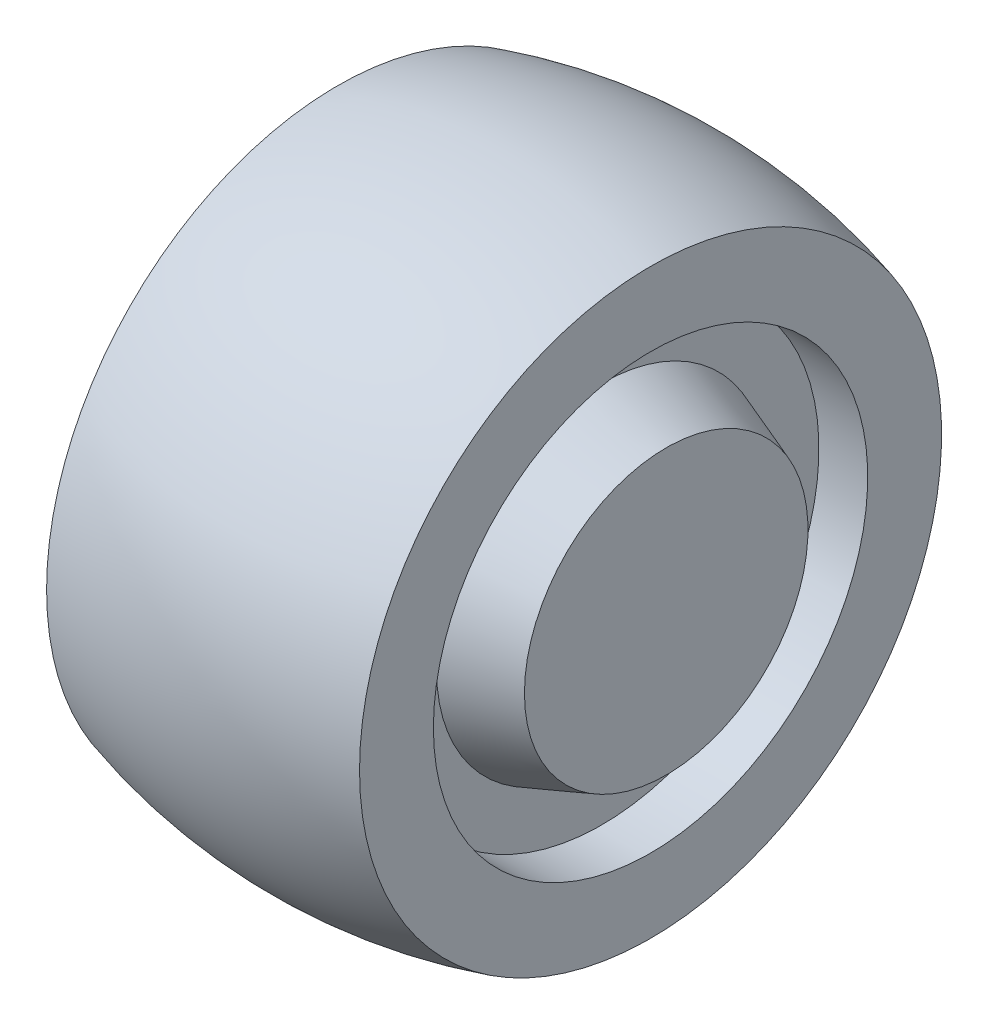
ISO-10303-21;
HEADER;
FILE_DESCRIPTION(('STEP AP214'),'2;1');
FILE_NAME('part.step','',(''),(''),'','','');
FILE_SCHEMA(('AUTOMOTIVE_DESIGN { 1 0 10303 214 1 1 1 1 }'));
ENDSEC;
DATA;
#1=APPLICATION_CONTEXT('core data for automotive mechanical design processes');
#2=APPLICATION_PROTOCOL_DEFINITION('international standard','automotive_design',2000,#1);
#3=PRODUCT_CONTEXT('',#1,'mechanical');
#4=PRODUCT('Part','Part','',(#3));
#5=PRODUCT_RELATED_PRODUCT_CATEGORY('part','',(#4));
#6=PRODUCT_DEFINITION_FORMATION('','',#4);
#7=PRODUCT_DEFINITION_CONTEXT('part definition',#1,'design');
#8=PRODUCT_DEFINITION('design','',#6,#7);
#9=PRODUCT_DEFINITION_SHAPE('','',#8);
#10=(LENGTH_UNIT() NAMED_UNIT(*) SI_UNIT(.MILLI.,.METRE.));
#11=(NAMED_UNIT(*) PLANE_ANGLE_UNIT() SI_UNIT($,.RADIAN.));
#12=(NAMED_UNIT(*) SI_UNIT($,.STERADIAN.) SOLID_ANGLE_UNIT());
#13=UNCERTAINTY_MEASURE_WITH_UNIT(LENGTH_MEASURE(1.E-05),#10,'distance_accuracy_value','');
#14=(GEOMETRIC_REPRESENTATION_CONTEXT(3) GLOBAL_UNCERTAINTY_ASSIGNED_CONTEXT((#13)) GLOBAL_UNIT_ASSIGNED_CONTEXT((#10,
#11,#12)) REPRESENTATION_CONTEXT('',''));
#15=CARTESIAN_POINT('',(0.,0.,0.));
#16=DIRECTION('',(0.,0.,1.));
#17=DIRECTION('',(1.,0.,0.));
#18=AXIS2_PLACEMENT_3D('',#15,#16,#17);
#19=CARTESIAN_POINT('',(13.97,0.,0.));
#20=DIRECTION('',(-1.,0.,0.));
#21=DIRECTION('',(0.,0.,1.));
#22=AXIS2_PLACEMENT_3D('',#19,#20,#21);
#23=PLANE('',#22);
#24=CARTESIAN_POINT('',(13.9699999999999,0.,0.));
#25=DIRECTION('',(-1.,0.,0.));
#26=DIRECTION('',(0.,0.,1.));
#27=AXIS2_PLACEMENT_3D('',#24,#25,#26);
#28=CIRCLE('',#27,11.5061999999997);
#29=CARTESIAN_POINT('',(13.9699999999999,0.,11.5061999999997));
#30=VERTEX_POINT('',#29);
#31=EDGE_CURVE('E19',#30,#30,#28,.T.);
#32=ORIENTED_EDGE('',*,*,#31,.F.);
#33=EDGE_LOOP('',(#32));
#34=FACE_BOUND('',#33,.T.);
#35=ADVANCED_FACE('F15',(#34),#23,.F.);
#36=CARTESIAN_POINT('',(-13.97,0.,0.));
#37=DIRECTION('',(1.,0.,0.));
#38=DIRECTION('',(0.,0.,-1.));
#39=AXIS2_PLACEMENT_3D('',#36,#37,#38);
#40=PLANE('',#39);
#41=CARTESIAN_POINT('',(-13.9699999999999,0.,0.));
#42=DIRECTION('',(1.,0.,0.));
#43=DIRECTION('',(0.,0.,-1.));
#44=AXIS2_PLACEMENT_3D('',#41,#42,#43);
#45=CIRCLE('',#44,11.5061999999997);
#46=CARTESIAN_POINT('',(-13.9699999999999,0.,-11.5061999999997));
#47=VERTEX_POINT('',#46);
#48=EDGE_CURVE('E47',#47,#47,#45,.T.);
#49=ORIENTED_EDGE('',*,*,#48,.F.);
#50=EDGE_LOOP('',(#49));
#51=FACE_BOUND('',#50,.T.);
#52=ADVANCED_FACE('F57',(#51),#40,.F.);
#53=CARTESIAN_POINT('',(8.7376000000001,0.,0.));
#54=DIRECTION('',(-1.,0.,0.));
#55=DIRECTION('',(0.,0.,1.));
#56=AXIS2_PLACEMENT_3D('',#53,#54,#55);
#57=CONICAL_SURFACE('',#56,13.4106378537738,0.3490658503988);
#58=CARTESIAN_POINT('',(8.73760000000009,0.,0.));
#59=DIRECTION('',(-1.,0.,0.));
#60=DIRECTION('',(0.,0.,1.));
#61=AXIS2_PLACEMENT_3D('',#58,#59,#60);
#62=CIRCLE('',#61,13.4106378537738);
#63=CARTESIAN_POINT('',(8.73760000000009,0.,13.4106378537738));
#64=VERTEX_POINT('',#63);
#65=EDGE_CURVE('E45',#64,#64,#62,.F.);
#66=ORIENTED_EDGE('',*,*,#65,.T.);
#67=EDGE_LOOP('',(#66));
#68=FACE_BOUND('',#67,.T.);
#69=ORIENTED_EDGE('',*,*,#31,.T.);
#70=EDGE_LOOP('',(#69));
#71=FACE_BOUND('',#70,.T.);
#72=ADVANCED_FACE('F54',(#68,#71),#57,.T.);
#73=CARTESIAN_POINT('',(-8.7376000000001,0.,0.));
#74=DIRECTION('',(1.,0.,0.));
#75=DIRECTION('',(0.,0.,-1.));
#76=AXIS2_PLACEMENT_3D('',#73,#74,#75);
#77=CONICAL_SURFACE('',#76,13.4106378537738,0.3490658503988);
#78=CARTESIAN_POINT('',(-8.73760000000009,0.,0.));
#79=DIRECTION('',(1.,0.,0.));
#80=DIRECTION('',(0.,0.,-1.));
#81=AXIS2_PLACEMENT_3D('',#78,#79,#80);
#82=CIRCLE('',#81,13.4106378537738);
#83=CARTESIAN_POINT('',(-8.73760000000009,0.,-13.4106378537738));
#84=VERTEX_POINT('',#83);
#85=EDGE_CURVE('E42',#84,#84,#82,.F.);
#86=ORIENTED_EDGE('',*,*,#85,.T.);
#87=EDGE_LOOP('',(#86));
#88=FACE_BOUND('',#87,.T.);
#89=ORIENTED_EDGE('',*,*,#48,.T.);
#90=EDGE_LOOP('',(#89));
#91=FACE_BOUND('',#90,.T.);
#92=ADVANCED_FACE('F97',(#88,#91),#77,.T.);
#93=CARTESIAN_POINT('',(8.7376,13.4106378537735,0.));
#94=DIRECTION('',(-1.,0.,0.));
#95=DIRECTION('',(0.,0.,1.));
#96=AXIS2_PLACEMENT_3D('',#93,#94,#95);
#97=PLANE('',#96);
#98=ORIENTED_EDGE('',*,*,#65,.F.);
#99=EDGE_LOOP('',(#98));
#100=FACE_BOUND('',#99,.T.);
#101=CARTESIAN_POINT('',(8.7376,0.,0.));
#102=DIRECTION('',(-1.,0.,0.));
#103=DIRECTION('',(0.,0.,1.));
#104=AXIS2_PLACEMENT_3D('',#101,#102,#103);
#105=CIRCLE('',#104,17.6276);
#106=CARTESIAN_POINT('',(8.7376,0.,17.6276));
#107=VERTEX_POINT('',#106);
#108=EDGE_CURVE('E39',#107,#107,#105,.F.);
#109=ORIENTED_EDGE('',*,*,#108,.T.);
#110=EDGE_LOOP('',(#109));
#111=FACE_BOUND('',#110,.T.);
#112=ADVANCED_FACE('F93',(#100,#111),#97,.F.);
#113=CARTESIAN_POINT('',(-8.7376,13.4106378537735,0.));
#114=DIRECTION('',(1.,0.,0.));
#115=DIRECTION('',(0.,0.,-1.));
#116=AXIS2_PLACEMENT_3D('',#113,#114,#115);
#117=PLANE('',#116);
#118=ORIENTED_EDGE('',*,*,#85,.F.);
#119=EDGE_LOOP('',(#118));
#120=FACE_BOUND('',#119,.T.);
#121=CARTESIAN_POINT('',(-8.7376,0.,0.));
#122=DIRECTION('',(-1.,0.,0.));
#123=DIRECTION('',(0.,0.,1.));
#124=AXIS2_PLACEMENT_3D('',#121,#122,#123);
#125=CIRCLE('',#124,17.6276);
#126=CARTESIAN_POINT('',(-8.7376,0.,17.6276));
#127=VERTEX_POINT('',#126);
#128=EDGE_CURVE('E36',#127,#127,#125,.T.);
#129=ORIENTED_EDGE('',*,*,#128,.T.);
#130=EDGE_LOOP('',(#129));
#131=FACE_BOUND('',#130,.T.);
#132=ADVANCED_FACE('F89',(#120,#131),#117,.F.);
#133=CARTESIAN_POINT('',(-16.8275,0.,0.));
#134=DIRECTION('',(-1.,0.,0.));
#135=DIRECTION('',(0.,0.,1.));
#136=AXIS2_PLACEMENT_3D('',#133,#134,#135);
#137=CYLINDRICAL_SURFACE('',#136,17.6276);
#138=ORIENTED_EDGE('',*,*,#108,.F.);
#139=EDGE_LOOP('',(#138));
#140=FACE_BOUND('',#139,.T.);
#141=CARTESIAN_POINT('',(12.7,0.,0.));
#142=DIRECTION('',(-1.,0.,0.));
#143=DIRECTION('',(0.,0.,1.));
#144=AXIS2_PLACEMENT_3D('',#141,#142,#143);
#145=CIRCLE('',#144,17.6276);
#146=CARTESIAN_POINT('',(12.7,0.,17.6276));
#147=VERTEX_POINT('',#146);
#148=EDGE_CURVE('E33',#147,#147,#145,.F.);
#149=ORIENTED_EDGE('',*,*,#148,.T.);
#150=EDGE_LOOP('',(#149));
#151=FACE_BOUND('',#150,.T.);
#152=ADVANCED_FACE('F82',(#140,#151),#137,.F.);
#153=CARTESIAN_POINT('',(-16.8275,0.,0.));
#154=DIRECTION('',(-1.,0.,0.));
#155=DIRECTION('',(0.,0.,1.));
#156=AXIS2_PLACEMENT_3D('',#153,#154,#155);
#157=CYLINDRICAL_SURFACE('',#156,17.6276);
#158=CARTESIAN_POINT('',(-12.7,0.,0.));
#159=DIRECTION('',(-1.,0.,0.));
#160=DIRECTION('',(0.,0.,1.));
#161=AXIS2_PLACEMENT_3D('',#158,#159,#160);
#162=CIRCLE('',#161,17.6276);
#163=CARTESIAN_POINT('',(-12.7,0.,17.6276));
#164=VERTEX_POINT('',#163);
#165=EDGE_CURVE('E28',#164,#164,#162,.T.);
#166=ORIENTED_EDGE('',*,*,#165,.T.);
#167=EDGE_LOOP('',(#166));
#168=FACE_BOUND('',#167,.T.);
#169=ORIENTED_EDGE('',*,*,#128,.F.);
#170=EDGE_LOOP('',(#169));
#171=FACE_BOUND('',#170,.T.);
#172=ADVANCED_FACE('F76',(#168,#171),#157,.F.);
#173=CARTESIAN_POINT('',(12.7,17.6276,0.));
#174=DIRECTION('',(-1.,0.,0.));
#175=DIRECTION('',(0.,0.,1.));
#176=AXIS2_PLACEMENT_3D('',#173,#174,#175);
#177=PLANE('',#176);
#178=ORIENTED_EDGE('',*,*,#148,.F.);
#179=EDGE_LOOP('',(#178));
#180=FACE_BOUND('',#179,.T.);
#181=CARTESIAN_POINT('',(12.6999999999998,-8.35964746132077E-13,0.));
#182=DIRECTION('',(-1.,0.,0.));
#183=DIRECTION('',(0.,0.,1.));
#184=AXIS2_PLACEMENT_3D('',#181,#182,#183);
#185=CIRCLE('',#184,23.6219999999995);
#186=CARTESIAN_POINT('',(12.6999999999999,-8.35964746132077E-13,23.6219999999995));
#187=VERTEX_POINT('',#186);
#188=EDGE_CURVE('E23',#187,#187,#185,.T.);
#189=ORIENTED_EDGE('',*,*,#188,.F.);
#190=EDGE_LOOP('',(#189));
#191=FACE_BOUND('',#190,.T.);
#192=ADVANCED_FACE('F69',(#180,#191),#177,.F.);
#193=CARTESIAN_POINT('',(-12.7,17.6276,0.));
#194=DIRECTION('',(1.,0.,0.));
#195=DIRECTION('',(0.,0.,-1.));
#196=AXIS2_PLACEMENT_3D('',#193,#194,#195);
#197=PLANE('',#196);
#198=ORIENTED_EDGE('',*,*,#165,.F.);
#199=EDGE_LOOP('',(#198));
#200=FACE_BOUND('',#199,.T.);
#201=CARTESIAN_POINT('',(-12.6999999999999,-8.30237152543647E-13,0.));
#202=DIRECTION('',(-1.,0.,0.));
#203=DIRECTION('',(0.,0.,1.));
#204=AXIS2_PLACEMENT_3D('',#201,#202,#203);
#205=CIRCLE('',#204,23.6219999999995);
#206=CARTESIAN_POINT('',(-12.6999999999998,-8.30237152543647E-13,23.6219999999995));
#207=VERTEX_POINT('',#206);
#208=EDGE_CURVE('E10',#207,#207,#205,.F.);
#209=ORIENTED_EDGE('',*,*,#208,.F.);
#210=EDGE_LOOP('',(#209));
#211=FACE_BOUND('',#210,.T.);
#212=ADVANCED_FACE('F65',(#200,#211),#197,.F.);
#213=CARTESIAN_POINT('',(0.,-8.33100949337862E-13,0.));
#214=DIRECTION('',(-1.,0.,0.));
#215=DIRECTION('',(0.,0.,1.));
#216=AXIS2_PLACEMENT_3D('',#213,#214,#215);
#217=DEGENERATE_TOROIDAL_SURFACE('',#216,20.8461428570374,46.2461428570408,.F.);
#218=ORIENTED_EDGE('',*,*,#208,.T.);
#219=EDGE_LOOP('',(#218));
#220=FACE_BOUND('',#219,.T.);
#221=ORIENTED_EDGE('',*,*,#188,.T.);
#222=EDGE_LOOP('',(#221));
#223=FACE_BOUND('',#222,.T.);
#224=ADVANCED_FACE('F17',(#220,#223),#217,.F.);
#225=CLOSED_SHELL('',(#35,#52,#72,#92,#112,#132,#152,#172,#192,#212,#224));
#226=MANIFOLD_SOLID_BREP('B1',#225);
#227=ADVANCED_BREP_SHAPE_REPRESENTATION('',(#18,#226),#14);
#228=SHAPE_DEFINITION_REPRESENTATION(#9,#227);
ENDSEC;
END-ISO-10303-21;
